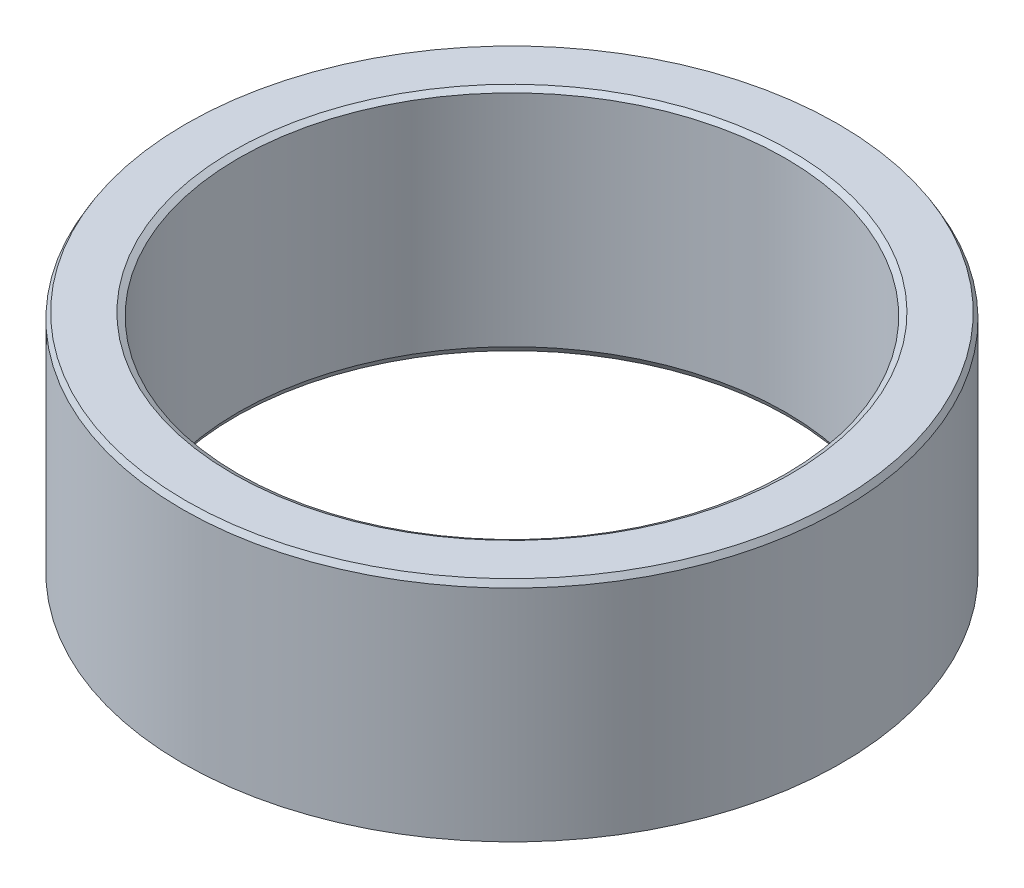
ISO-10303-21;
HEADER;
FILE_DESCRIPTION(('STEP AP214'),'2;1');
FILE_NAME('part.step','',(''),(''),'','','');
FILE_SCHEMA(('AUTOMOTIVE_DESIGN { 1 0 10303 214 1 1 1 1 }'));
ENDSEC;
DATA;
#1=APPLICATION_CONTEXT('core data for automotive mechanical design processes');
#2=APPLICATION_PROTOCOL_DEFINITION('international standard','automotive_design',2000,#1);
#3=PRODUCT_CONTEXT('',#1,'mechanical');
#4=PRODUCT('Part','Part','',(#3));
#5=PRODUCT_RELATED_PRODUCT_CATEGORY('part','',(#4));
#6=PRODUCT_DEFINITION_FORMATION('','',#4);
#7=PRODUCT_DEFINITION_CONTEXT('part definition',#1,'design');
#8=PRODUCT_DEFINITION('design','',#6,#7);
#9=PRODUCT_DEFINITION_SHAPE('','',#8);
#10=(LENGTH_UNIT() NAMED_UNIT(*) SI_UNIT(.MILLI.,.METRE.));
#11=(NAMED_UNIT(*) PLANE_ANGLE_UNIT() SI_UNIT($,.RADIAN.));
#12=(NAMED_UNIT(*) SI_UNIT($,.STERADIAN.) SOLID_ANGLE_UNIT());
#13=UNCERTAINTY_MEASURE_WITH_UNIT(LENGTH_MEASURE(1.E-05),#10,'distance_accuracy_value','');
#14=(GEOMETRIC_REPRESENTATION_CONTEXT(3) GLOBAL_UNCERTAINTY_ASSIGNED_CONTEXT((#13)) GLOBAL_UNIT_ASSIGNED_CONTEXT((#10,
#11,#12)) REPRESENTATION_CONTEXT('',''));
#15=CARTESIAN_POINT('',(0.,0.,0.));
#16=DIRECTION('',(0.,0.,1.));
#17=DIRECTION('',(1.,0.,0.));
#18=AXIS2_PLACEMENT_3D('',#15,#16,#17);
#19=CARTESIAN_POINT('',(0.,36.4788940203229,0.));
#20=DIRECTION('',(0.,-1.,0.));
#21=DIRECTION('',(0.,0.,-1.));
#22=AXIS2_PLACEMENT_3D('',#19,#20,#21);
#23=CYLINDRICAL_SURFACE('',#22,52.5);
#24=CARTESIAN_POINT('',(0.,0.534971164588442,0.));
#25=DIRECTION('',(0.,1.,0.));
#26=DIRECTION('',(0.,0.,1.));
#27=AXIS2_PLACEMENT_3D('',#24,#25,#26);
#28=CIRCLE('',#27,52.5);
#29=CARTESIAN_POINT('',(0.,0.534971164588442,52.5));
#30=VERTEX_POINT('',#29);
#31=EDGE_CURVE('E10',#30,#30,#28,.T.);
#32=ORIENTED_EDGE('',*,*,#31,.T.);
#33=EDGE_LOOP('',(#32));
#34=FACE_BOUND('',#33,.T.);
#35=CARTESIAN_POINT('',(0.,35.5522967826713,0.));
#36=DIRECTION('',(0.,1.,0.));
#37=DIRECTION('',(0.,0.,1.));
#38=AXIS2_PLACEMENT_3D('',#35,#36,#37);
#39=CIRCLE('',#38,52.5);
#40=CARTESIAN_POINT('',(0.,35.5522967826713,52.5));
#41=VERTEX_POINT('',#40);
#42=EDGE_CURVE('E50',#41,#41,#39,.F.);
#43=ORIENTED_EDGE('',*,*,#42,.T.);
#44=EDGE_LOOP('',(#43));
#45=FACE_BOUND('',#44,.T.);
#46=ADVANCED_FACE('F39',(#34,#45),#23,.T.);
#47=CARTESIAN_POINT('',(0.,36.4788940203229,0.));
#48=DIRECTION('',(0.,1.,0.));
#49=DIRECTION('',(0.,0.,1.));
#50=AXIS2_PLACEMENT_3D('',#47,#48,#49);
#51=PLANE('',#50);
#52=CARTESIAN_POINT('',(0.,36.4788940203229,0.));
#53=DIRECTION('',(0.,1.,0.));
#54=DIRECTION('',(0.,0.,1.));
#55=AXIS2_PLACEMENT_3D('',#52,#53,#54);
#56=CIRCLE('',#55,44.5001398030729);
#57=CARTESIAN_POINT('',(0.,36.4788940203229,44.5001398030729));
#58=VERTEX_POINT('',#57);
#59=EDGE_CURVE('E58',#58,#58,#56,.F.);
#60=ORIENTED_EDGE('',*,*,#59,.T.);
#61=EDGE_LOOP('',(#60));
#62=FACE_BOUND('',#61,.T.);
#63=CARTESIAN_POINT('',(0.,36.4788940203229,0.));
#64=DIRECTION('',(0.,1.,0.));
#65=DIRECTION('',(0.,0.,1.));
#66=AXIS2_PLACEMENT_3D('',#63,#64,#65);
#67=CIRCLE('',#66,51.9650288354115);
#68=CARTESIAN_POINT('',(0.,36.4788940203229,51.9650288354115));
#69=VERTEX_POINT('',#68);
#70=EDGE_CURVE('E61',#69,#69,#67,.T.);
#71=ORIENTED_EDGE('',*,*,#70,.T.);
#72=EDGE_LOOP('',(#71));
#73=FACE_BOUND('',#72,.T.);
#74=ADVANCED_FACE('F88',(#62,#73),#51,.T.);
#75=CARTESIAN_POINT('',(0.,0.,0.));
#76=DIRECTION('',(0.,1.,0.));
#77=DIRECTION('',(0.,0.,1.));
#78=AXIS2_PLACEMENT_3D('',#75,#76,#77);
#79=PLANE('',#78);
#80=CARTESIAN_POINT('',(0.,0.,0.));
#81=DIRECTION('',(0.,1.,0.));
#82=DIRECTION('',(0.,0.,1.));
#83=AXIS2_PLACEMENT_3D('',#80,#81,#82);
#84=CIRCLE('',#83,44.1085137300098);
#85=CARTESIAN_POINT('',(0.,0.,-44.1085137300098));
#86=VERTEX_POINT('',#85);
#87=EDGE_CURVE('E51',#86,#86,#84,.T.);
#88=ORIENTED_EDGE('',*,*,#87,.T.);
#89=EDGE_LOOP('',(#88));
#90=FACE_BOUND('',#89,.T.);
#91=CARTESIAN_POINT('',(0.,0.,0.));
#92=DIRECTION('',(0.,1.,0.));
#93=DIRECTION('',(0.,0.,1.));
#94=AXIS2_PLACEMENT_3D('',#91,#92,#93);
#95=CIRCLE('',#94,51.5734027623485);
#96=CARTESIAN_POINT('',(0.,0.,51.5734027623485));
#97=VERTEX_POINT('',#96);
#98=EDGE_CURVE('E54',#97,#97,#95,.F.);
#99=ORIENTED_EDGE('',*,*,#98,.T.);
#100=EDGE_LOOP('',(#99));
#101=FACE_BOUND('',#100,.T.);
#102=ADVANCED_FACE('F83',(#90,#101),#79,.F.);
#103=CARTESIAN_POINT('',(0.,36.4788940203229,0.));
#104=DIRECTION('',(0.,-1.,0.));
#105=DIRECTION('',(0.,0.,-1.));
#106=AXIS2_PLACEMENT_3D('',#103,#104,#105);
#107=CYLINDRICAL_SURFACE('',#106,43.5735425654213);
#108=CARTESIAN_POINT('',(0.,35.9439228557344,0.));
#109=DIRECTION('',(0.,1.,0.));
#110=DIRECTION('',(0.,0.,1.));
#111=AXIS2_PLACEMENT_3D('',#108,#109,#110);
#112=CIRCLE('',#111,43.5735425654213);
#113=CARTESIAN_POINT('',(0.,35.9439228557344,43.5735425654213));
#114=VERTEX_POINT('',#113);
#115=EDGE_CURVE('E67',#114,#114,#112,.T.);
#116=ORIENTED_EDGE('',*,*,#115,.T.);
#117=EDGE_LOOP('',(#116));
#118=FACE_BOUND('',#117,.T.);
#119=CARTESIAN_POINT('',(0.,0.926597237651497,0.));
#120=DIRECTION('',(0.,1.,0.));
#121=DIRECTION('',(0.,0.,1.));
#122=AXIS2_PLACEMENT_3D('',#119,#120,#121);
#123=CIRCLE('',#122,43.5735425654213);
#124=CARTESIAN_POINT('',(0.,0.926597237651497,-43.5735425654213));
#125=VERTEX_POINT('',#124);
#126=EDGE_CURVE('E69',#125,#125,#123,.F.);
#127=ORIENTED_EDGE('',*,*,#126,.T.);
#128=EDGE_LOOP('',(#127));
#129=FACE_BOUND('',#128,.T.);
#130=ADVANCED_FACE('F71',(#118,#129),#107,.F.);
#131=CARTESIAN_POINT('',(0.,35.9439228557344,0.));
#132=DIRECTION('',(0.,1.,0.));
#133=DIRECTION('',(0.,0.,1.));
#134=AXIS2_PLACEMENT_3D('',#131,#132,#133);
#135=CONICAL_SURFACE('',#134,43.5735425654213,1.04719755119661);
#136=ORIENTED_EDGE('',*,*,#59,.F.);
#137=EDGE_LOOP('',(#136));
#138=FACE_BOUND('',#137,.T.);
#139=ORIENTED_EDGE('',*,*,#115,.F.);
#140=EDGE_LOOP('',(#139));
#141=FACE_BOUND('',#140,.T.);
#142=ADVANCED_FACE('F77',(#138,#141),#135,.F.);
#143=CARTESIAN_POINT('',(0.,0.,0.));
#144=DIRECTION('',(0.,-1.,0.));
#145=DIRECTION('',(0.,0.,-1.));
#146=AXIS2_PLACEMENT_3D('',#143,#144,#145);
#147=CONICAL_SURFACE('',#146,44.1085137300098,0.523598775598299);
#148=CARTESIAN_POINT('',(0.,0.926597237651497,-43.5735425654213));
#149=CARTESIAN_POINT('',(0.,0.916945183092629,-43.5791151817191));
#150=CARTESIAN_POINT('',(0.,0.907293128533758,-43.584687798017));
#151=CARTESIAN_POINT('',(0.,0.887989019416018,-43.5958330306125));
#152=CARTESIAN_POINT('',(0.,0.878336964857147,-43.6014056469103));
#153=CARTESIAN_POINT('',(0.,0.859032855739408,-43.6125508795059));
#154=CARTESIAN_POINT('',(0.,0.849380801180539,-43.6181234958037));
#155=CARTESIAN_POINT('',(0.,0.8300766920628,-43.6292687283993));
#156=CARTESIAN_POINT('',(0.,0.820424637503929,-43.6348413446971));
#157=CARTESIAN_POINT('',(0.,0.80112052838619,-43.6459865772927));
#158=CARTESIAN_POINT('',(0.,0.791468473827321,-43.6515591935905));
#159=CARTESIAN_POINT('',(0.,0.772164364709581,-43.6627044261861));
#160=CARTESIAN_POINT('',(0.,0.76251231015071,-43.6682770424839));
#161=CARTESIAN_POINT('',(0.,0.743208201032971,-43.6794222750795));
#162=CARTESIAN_POINT('',(0.,0.733556146474102,-43.6849948913773));
#163=CARTESIAN_POINT('',(0.,0.714252037356363,-43.6961401239729));
#164=CARTESIAN_POINT('',(0.,0.704599982797492,-43.7017127402707));
#165=CARTESIAN_POINT('',(0.,0.685295873679752,-43.7128579728663));
#166=CARTESIAN_POINT('',(0.,0.675643819120884,-43.7184305891641));
#167=CARTESIAN_POINT('',(0.,0.656339710003144,-43.7295758217596));
#168=CARTESIAN_POINT('',(0.,0.646687655444273,-43.7351484380574));
#169=CARTESIAN_POINT('',(0.,0.627383546326534,-43.746293670653));
#170=CARTESIAN_POINT('',(0.,0.617731491767665,-43.7518662869508));
#171=CARTESIAN_POINT('',(0.,0.598427382649926,-43.7630115195464));
#172=CARTESIAN_POINT('',(0.,0.588775328091055,-43.7685841358442));
#173=CARTESIAN_POINT('',(0.,0.569471218973315,-43.7797293684398));
#174=CARTESIAN_POINT('',(0.,0.559819164414446,-43.7853019847376));
#175=CARTESIAN_POINT('',(0.,0.540515055296707,-43.7964472173332));
#176=CARTESIAN_POINT('',(0.,0.530863000737836,-43.802019833631));
#177=CARTESIAN_POINT('',(0.,0.511558891620097,-43.8131650662266));
#178=CARTESIAN_POINT('',(0.,0.501906837061228,-43.8187376825244));
#179=CARTESIAN_POINT('',(0.,0.482602727943488,-43.82988291512));
#180=CARTESIAN_POINT('',(0.,0.472950673384618,-43.8354555314178));
#181=CARTESIAN_POINT('',(0.,0.453646564266878,-43.8466007640134));
#182=CARTESIAN_POINT('',(0.,0.443994509708009,-43.8521733803112));
#183=CARTESIAN_POINT('',(0.,0.42469040059027,-43.8633186129068));
#184=CARTESIAN_POINT('',(0.,0.4150383460314,-43.8688912292046));
#185=CARTESIAN_POINT('',(0.,0.39573423691366,-43.8800364618002));
#186=CARTESIAN_POINT('',(0.,0.38608218235479,-43.8856090780979));
#187=CARTESIAN_POINT('',(0.,0.36677807323705,-43.8967543106935));
#188=CARTESIAN_POINT('',(0.,0.357126018678182,-43.9023269269913));
#189=CARTESIAN_POINT('',(0.,0.337821909560442,-43.9134721595869));
#190=CARTESIAN_POINT('',(0.,0.328169855001571,-43.9190447758847));
#191=CARTESIAN_POINT('',(0.,0.308865745883832,-43.9301900084803));
#192=CARTESIAN_POINT('',(0.,0.299213691324963,-43.9357626247781));
#193=CARTESIAN_POINT('',(0.,0.279909582207223,-43.9469078573737));
#194=CARTESIAN_POINT('',(0.,0.270257527648353,-43.9524804736715));
#195=CARTESIAN_POINT('',(0.,0.250953418530613,-43.9636257062671));
#196=CARTESIAN_POINT('',(0.,0.241301363971744,-43.9691983225649));
#197=CARTESIAN_POINT('',(0.,0.221997254854005,-43.9803435551605));
#198=CARTESIAN_POINT('',(0.,0.212345200295134,-43.9859161714583));
#199=CARTESIAN_POINT('',(0.,0.193041091177395,-43.9970614040539));
#200=CARTESIAN_POINT('',(0.,0.183389036618526,-44.0026340203517));
#201=CARTESIAN_POINT('',(0.,0.164084927500786,-44.0137792529473));
#202=CARTESIAN_POINT('',(0.,0.154432872941916,-44.0193518692451));
#203=CARTESIAN_POINT('',(0.,0.135128763824176,-44.0304971018407));
#204=CARTESIAN_POINT('',(0.,0.125476709265307,-44.0360697181384));
#205=CARTESIAN_POINT('',(0.,0.106172600147568,-44.047214950734));
#206=CARTESIAN_POINT('',(0.,0.0965205455886971,-44.0527875670318));
#207=CARTESIAN_POINT('',(0.,0.0772164364709575,-44.0639327996274));
#208=CARTESIAN_POINT('',(0.,0.0675643819120887,-44.0695054159252));
#209=CARTESIAN_POINT('',(0.,0.0482602727943494,-44.0806506485208));
#210=CARTESIAN_POINT('',(0.,0.0386082182354791,-44.0862232648186));
#211=CARTESIAN_POINT('',(0.,0.0193041091177384,-44.0973684974142));
#212=CARTESIAN_POINT('',(0.,0.00965205455886812,-44.102941113712));
#213=CARTESIAN_POINT('',(0.,0.,-44.1085137300098));
#214=B_SPLINE_CURVE_WITH_KNOTS('',3,(#148,#149,#150,#151,#152,#153,#154,#155,#156,#157,#158,
#159,#160,#161,#162,#163,#164,#165,#166,#167,#168,#169,#170,#171,#172,#173,#174,#175,#176,#177,
#178,#179,#180,#181,#182,#183,#184,#185,#186,#187,#188,#189,#190,#191,#192,#193,#194,#195,#196,
#197,#198,#199,#200,#201,#202,#203,#204,#205,#206,#207,#208,#209,#210,#211,#212,#213),
.UNSPECIFIED.,.F.,.F.,(4,2,2,2,2,2,2,2,2,2,2,2,2,2,2,2,2,2,2,2,2,2,2,2,2,2,2,2,2,2,2,2,4),(0.,
0.0334356977867801,0.0668713955735567,0.100307093360337,0.133742791147113,0.167178488933894,
0.20061418672067,0.23404988450745,0.267485582294227,0.300921280081007,0.334356977867784,
0.367792675654564,0.40122837344134,0.43466407122812,0.468099769014897,0.501535466801677,
0.534971164588454,0.568406862375234,0.601842560162014,0.635278257948791,0.668713955735571,
0.702149653522347,0.735585351309127,0.769021049095904,0.802456746882684,0.835892444669461,
0.869328142456241,0.902763840243018,0.936199538029798,0.969635235816574,1.00307093360335,
1.03650663139013,1.06994232917691),.UNSPECIFIED.);
#215=EDGE_CURVE('BSEAM73',#125,#86,#214,.T.);
#216=ORIENTED_EDGE('',*,*,#126,.F.);
#217=ORIENTED_EDGE('',*,*,#87,.F.);
#218=ORIENTED_EDGE('',*,*,#215,.T.);
#219=ORIENTED_EDGE('',*,*,#215,.F.);
#220=EDGE_LOOP('',(#216,#218,#217,#219));
#221=FACE_BOUND('',#220,.T.);
#222=ADVANCED_FACE('F73',(#221),#147,.F.);
#223=CARTESIAN_POINT('',(0.,0.534971164588442,0.));
#224=DIRECTION('',(0.,1.,0.));
#225=DIRECTION('',(0.,0.,1.));
#226=AXIS2_PLACEMENT_3D('',#223,#224,#225);
#227=CONICAL_SURFACE('',#226,52.5,1.0471975511966);
#228=ORIENTED_EDGE('',*,*,#98,.F.);
#229=EDGE_LOOP('',(#228));
#230=FACE_BOUND('',#229,.T.);
#231=ORIENTED_EDGE('',*,*,#31,.F.);
#232=EDGE_LOOP('',(#231));
#233=FACE_BOUND('',#232,.T.);
#234=ADVANCED_FACE('F76',(#230,#233),#227,.T.);
#235=CARTESIAN_POINT('',(0.,36.4788940203229,0.));
#236=DIRECTION('',(0.,-1.,0.));
#237=DIRECTION('',(0.,0.,-1.));
#238=AXIS2_PLACEMENT_3D('',#235,#236,#237);
#239=CONICAL_SURFACE('',#238,51.9650288354115,0.523598775598301);
#240=ORIENTED_EDGE('',*,*,#42,.F.);
#241=EDGE_LOOP('',(#240));
#242=FACE_BOUND('',#241,.T.);
#243=ORIENTED_EDGE('',*,*,#70,.F.);
#244=EDGE_LOOP('',(#243));
#245=FACE_BOUND('',#244,.T.);
#246=ADVANCED_FACE('F45',(#242,#245),#239,.T.);
#247=CLOSED_SHELL('',(#46,#74,#102,#130,#142,#222,#234,#246));
#248=MANIFOLD_SOLID_BREP('B2',#247);
#249=ADVANCED_BREP_SHAPE_REPRESENTATION('',(#18,#248),#14);
#250=SHAPE_DEFINITION_REPRESENTATION(#9,#249);
ENDSEC;
END-ISO-10303-21;
